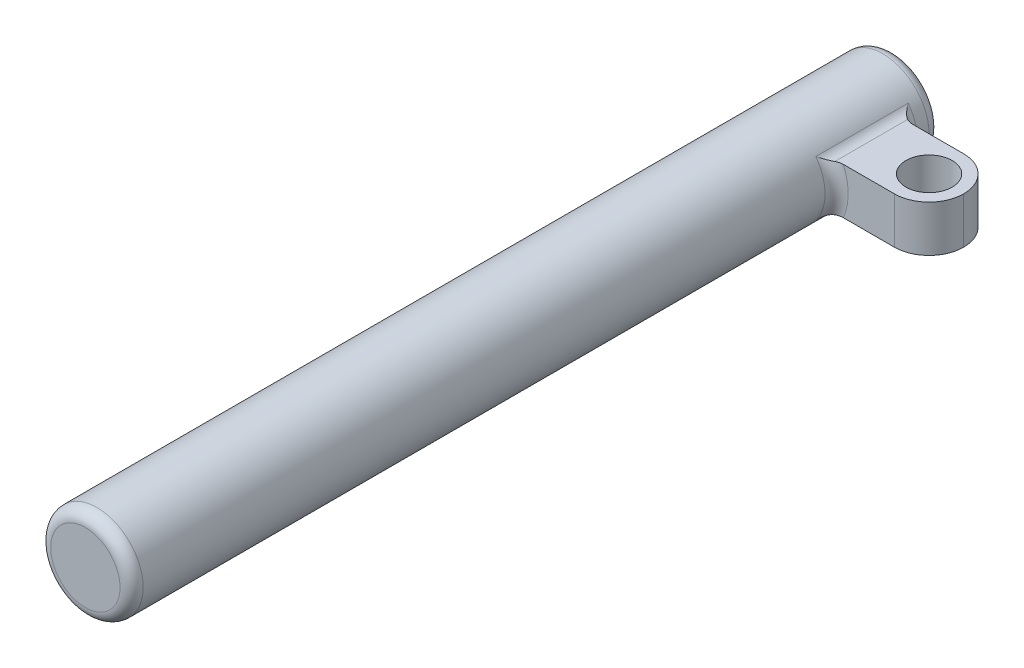
ISO-10303-21;
HEADER;
FILE_DESCRIPTION(('STEP AP214'),'2;1');
FILE_NAME('part.step','',(''),(''),'','','');
FILE_SCHEMA(('AUTOMOTIVE_DESIGN { 1 0 10303 214 1 1 1 1 }'));
ENDSEC;
DATA;
#1=APPLICATION_CONTEXT('core data for automotive mechanical design processes');
#2=APPLICATION_PROTOCOL_DEFINITION('international standard','automotive_design',2000,#1);
#3=PRODUCT_CONTEXT('',#1,'mechanical');
#4=PRODUCT('Part','Part','',(#3));
#5=PRODUCT_RELATED_PRODUCT_CATEGORY('part','',(#4));
#6=PRODUCT_DEFINITION_FORMATION('','',#4);
#7=PRODUCT_DEFINITION_CONTEXT('part definition',#1,'design');
#8=PRODUCT_DEFINITION('design','',#6,#7);
#9=PRODUCT_DEFINITION_SHAPE('','',#8);
#10=(LENGTH_UNIT() NAMED_UNIT(*) SI_UNIT(.MILLI.,.METRE.));
#11=(NAMED_UNIT(*) PLANE_ANGLE_UNIT() SI_UNIT($,.RADIAN.));
#12=(NAMED_UNIT(*) SI_UNIT($,.STERADIAN.) SOLID_ANGLE_UNIT());
#13=UNCERTAINTY_MEASURE_WITH_UNIT(LENGTH_MEASURE(1.E-05),#10,'distance_accuracy_value','');
#14=(GEOMETRIC_REPRESENTATION_CONTEXT(3) GLOBAL_UNCERTAINTY_ASSIGNED_CONTEXT((#13)) GLOBAL_UNIT_ASSIGNED_CONTEXT((#10,
#11,#12)) REPRESENTATION_CONTEXT('',''));
#15=CARTESIAN_POINT('',(0.,0.,0.));
#16=DIRECTION('',(0.,0.,1.));
#17=DIRECTION('',(1.,0.,0.));
#18=AXIS2_PLACEMENT_3D('',#15,#16,#17);
#19=CARTESIAN_POINT('',(0.,0.,88.8999999999999));
#20=DIRECTION('',(0.,0.,-1.));
#21=DIRECTION('',(-1.,0.,0.));
#22=AXIS2_PLACEMENT_3D('',#19,#20,#21);
#23=CYLINDRICAL_SURFACE('',#22,10.16);
#24=CARTESIAN_POINT('',(0.,0.,-83.82));
#25=DIRECTION('',(0.,0.,1.));
#26=DIRECTION('',(1.,0.,0.));
#27=AXIS2_PLACEMENT_3D('',#24,#25,#26);
#28=CIRCLE('',#27,10.16);
#29=CARTESIAN_POINT('',(8.128,6.096,-83.82));
#30=VERTEX_POINT('',#29);
#31=CARTESIAN_POINT('',(8.128,-6.096,-83.82));
#32=VERTEX_POINT('',#31);
#33=EDGE_CURVE('E154',#30,#32,#28,.F.);
#34=ORIENTED_EDGE('',*,*,#33,.T.);
#35=DIRECTION('',(0.,0.,-1.));
#36=VECTOR('',#35,1.);
#37=CARTESIAN_POINT('',(8.128,-6.096,88.8999999999999));
#38=LINE('',#37,#36);
#39=CARTESIAN_POINT('',(8.128,-6.096,-63.5));
#40=VERTEX_POINT('',#39);
#41=EDGE_CURVE('E159',#32,#40,#38,.F.);
#42=ORIENTED_EDGE('',*,*,#41,.T.);
#43=CARTESIAN_POINT('',(0.,0.,-63.5));
#44=DIRECTION('',(0.,0.,-1.));
#45=DIRECTION('',(-1.,0.,0.));
#46=AXIS2_PLACEMENT_3D('',#43,#44,#45);
#47=CIRCLE('',#46,10.16);
#48=CARTESIAN_POINT('',(8.128,6.096,-63.5));
#49=VERTEX_POINT('',#48);
#50=EDGE_CURVE('E156',#40,#49,#47,.F.);
#51=ORIENTED_EDGE('',*,*,#50,.T.);
#52=DIRECTION('',(0.,0.,-1.));
#53=VECTOR('',#52,1.);
#54=CARTESIAN_POINT('',(8.128,6.096,88.8999999999999));
#55=LINE('',#54,#53);
#56=EDGE_CURVE('E152',#49,#30,#55,.T.);
#57=ORIENTED_EDGE('',*,*,#56,.T.);
#58=EDGE_LOOP('',(#34,#42,#51,#57));
#59=FACE_BOUND('',#58,.T.);
#60=CARTESIAN_POINT('',(0.,0.,86.3599999999999));
#61=DIRECTION('',(0.,0.,1.));
#62=DIRECTION('',(1.,0.,0.));
#63=AXIS2_PLACEMENT_3D('',#60,#61,#62);
#64=CIRCLE('',#63,10.16);
#65=CARTESIAN_POINT('',(10.16,0.,86.3599999999999));
#66=VERTEX_POINT('',#65);
#67=EDGE_CURVE('E132',#66,#66,#64,.F.);
#68=ORIENTED_EDGE('',*,*,#67,.T.);
#69=EDGE_LOOP('',(#68));
#70=FACE_BOUND('',#69,.T.);
#71=CARTESIAN_POINT('',(0.,0.,-86.3599999999999));
#72=DIRECTION('',(0.,0.,1.));
#73=DIRECTION('',(1.,0.,0.));
#74=AXIS2_PLACEMENT_3D('',#71,#72,#73);
#75=CIRCLE('',#74,10.16);
#76=CARTESIAN_POINT('',(10.16,0.,-86.3599999999999));
#77=VERTEX_POINT('',#76);
#78=EDGE_CURVE('E230',#77,#77,#75,.T.);
#79=ORIENTED_EDGE('',*,*,#78,.T.);
#80=EDGE_LOOP('',(#79));
#81=FACE_BOUND('',#80,.T.);
#82=ADVANCED_FACE('F34',(#59,#70,#81),#23,.T.);
#83=CARTESIAN_POINT('',(0.,0.,88.8999999999999));
#84=DIRECTION('',(0.,0.,1.));
#85=DIRECTION('',(1.,0.,0.));
#86=AXIS2_PLACEMENT_3D('',#83,#84,#85);
#87=PLANE('',#86);
#88=CARTESIAN_POINT('',(0.,0.,88.8999999999999));
#89=DIRECTION('',(0.,0.,1.));
#90=DIRECTION('',(1.,0.,0.));
#91=AXIS2_PLACEMENT_3D('',#88,#89,#90);
#92=CIRCLE('',#91,7.62);
#93=CARTESIAN_POINT('',(7.62,0.,88.8999999999999));
#94=VERTEX_POINT('',#93);
#95=EDGE_CURVE('E236',#94,#94,#92,.T.);
#96=ORIENTED_EDGE('',*,*,#95,.T.);
#97=EDGE_LOOP('',(#96));
#98=FACE_BOUND('',#97,.T.);
#99=ADVANCED_FACE('F240',(#98),#87,.T.);
#100=CARTESIAN_POINT('',(0.,0.,-88.8999999999999));
#101=DIRECTION('',(0.,0.,1.));
#102=DIRECTION('',(1.,0.,0.));
#103=AXIS2_PLACEMENT_3D('',#100,#101,#102);
#104=PLANE('',#103);
#105=CARTESIAN_POINT('',(0.,0.,-88.8999999999999));
#106=DIRECTION('',(0.,0.,1.));
#107=DIRECTION('',(1.,0.,0.));
#108=AXIS2_PLACEMENT_3D('',#105,#106,#107);
#109=CIRCLE('',#108,7.62);
#110=CARTESIAN_POINT('',(7.62,0.,-88.8999999999999));
#111=VERTEX_POINT('',#110);
#112=EDGE_CURVE('E233',#111,#111,#109,.F.);
#113=ORIENTED_EDGE('',*,*,#112,.T.);
#114=EDGE_LOOP('',(#113));
#115=FACE_BOUND('',#114,.T.);
#116=ADVANCED_FACE('F252',(#115),#104,.F.);
#117=CARTESIAN_POINT('',(0.,0.,-86.3599999999999));
#118=DIRECTION('',(0.,0.,1.));
#119=DIRECTION('',(1.,0.,0.));
#120=AXIS2_PLACEMENT_3D('',#117,#118,#119);
#121=TOROIDAL_SURFACE('',#120,7.62,2.54);
#122=ORIENTED_EDGE('',*,*,#112,.F.);
#123=EDGE_LOOP('',(#122));
#124=FACE_BOUND('',#123,.T.);
#125=ORIENTED_EDGE('',*,*,#78,.F.);
#126=EDGE_LOOP('',(#125));
#127=FACE_BOUND('',#126,.T.);
#128=ADVANCED_FACE('F244',(#124,#127),#121,.T.);
#129=CARTESIAN_POINT('',(0.,0.,86.3599999999999));
#130=DIRECTION('',(0.,0.,1.));
#131=DIRECTION('',(1.,0.,0.));
#132=AXIS2_PLACEMENT_3D('',#129,#130,#131);
#133=TOROIDAL_SURFACE('',#132,7.62,2.54);
#134=ORIENTED_EDGE('',*,*,#67,.F.);
#135=EDGE_LOOP('',(#134));
#136=FACE_BOUND('',#135,.T.);
#137=ORIENTED_EDGE('',*,*,#95,.F.);
#138=EDGE_LOOP('',(#137));
#139=FACE_BOUND('',#138,.T.);
#140=ADVANCED_FACE('F242',(#136,#139),#133,.T.);
#141=CARTESIAN_POINT('',(30.48,5.08,-81.28));
#142=DIRECTION('',(0.,0.,1.));
#143=DIRECTION('',(1.,0.,0.));
#144=AXIS2_PLACEMENT_3D('',#141,#142,#143);
#145=PLANE('',#144);
#146=DIRECTION('',(-1.,0.,0.));
#147=VECTOR('',#146,1.);
#148=CARTESIAN_POINT('',(30.48,-5.08,-81.28));
#149=LINE('',#148,#147);
#150=CARTESIAN_POINT('',(22.86,-5.08,-81.28));
#151=VERTEX_POINT('',#150);
#152=CARTESIAN_POINT('',(11.639742265187,-5.08,-81.28));
#153=VERTEX_POINT('',#152);
#154=EDGE_CURVE('E148',#151,#153,#149,.T.);
#155=ORIENTED_EDGE('',*,*,#154,.T.);
#156=CARTESIAN_POINT('',(0.,0.,-81.28));
#157=DIRECTION('',(0.,0.,1.));
#158=DIRECTION('',(1.,0.,0.));
#159=AXIS2_PLACEMENT_3D('',#156,#157,#158);
#160=CIRCLE('',#159,12.7);
#161=CARTESIAN_POINT('',(11.6397422651878,5.08,-81.28));
#162=VERTEX_POINT('',#161);
#163=EDGE_CURVE('E131',#153,#162,#160,.T.);
#164=ORIENTED_EDGE('',*,*,#163,.T.);
#165=DIRECTION('',(-1.,0.,0.));
#166=VECTOR('',#165,1.);
#167=CARTESIAN_POINT('',(30.48,5.08,-81.28));
#168=LINE('',#167,#166);
#169=CARTESIAN_POINT('',(22.86,5.08,-81.28));
#170=VERTEX_POINT('',#169);
#171=EDGE_CURVE('E114',#170,#162,#168,.T.);
#172=ORIENTED_EDGE('',*,*,#171,.F.);
#173=DIRECTION('',(0.,1.,0.));
#174=VECTOR('',#173,1.);
#175=CARTESIAN_POINT('',(22.86,-5.08,-81.28));
#176=LINE('',#175,#174);
#177=EDGE_CURVE('E123',#170,#151,#176,.F.);
#178=ORIENTED_EDGE('',*,*,#177,.T.);
#179=EDGE_LOOP('',(#155,#164,#172,#178));
#180=FACE_BOUND('',#179,.T.);
#181=ADVANCED_FACE('F128',(#180),#145,.F.);
#182=CARTESIAN_POINT('',(30.48,5.08,-66.04));
#183=DIRECTION('',(0.,-1.,0.));
#184=DIRECTION('',(0.,0.,-1.));
#185=AXIS2_PLACEMENT_3D('',#182,#183,#184);
#186=PLANE('',#185);
#187=CARTESIAN_POINT('',(22.86,5.08,-73.66));
#188=DIRECTION('',(0.,1.,0.));
#189=DIRECTION('',(0.,0.,1.));
#190=AXIS2_PLACEMENT_3D('',#187,#188,#189);
#191=CIRCLE('',#190,5.08);
#192=CARTESIAN_POINT('',(22.86,5.08,-68.58));
#193=VERTEX_POINT('',#192);
#194=EDGE_CURVE('E212',#193,#193,#191,.T.);
#195=ORIENTED_EDGE('',*,*,#194,.F.);
#196=EDGE_LOOP('',(#195));
#197=FACE_BOUND('',#196,.T.);
#198=CARTESIAN_POINT('',(11.6397422651878,5.08,-81.28));
#199=CARTESIAN_POINT('',(11.5529721894488,5.08,-81.2800075483944));
#200=CARTESIAN_POINT('',(11.4662619370639,5.08,-81.2837374348052));
#201=CARTESIAN_POINT('',(11.2934457056713,5.08,-81.2985670088406));
#202=CARTESIAN_POINT('',(11.2073399274719,5.08,-81.3096690383544));
#203=CARTESIAN_POINT('',(10.9544833609675,5.08,-81.3532717952978));
#204=CARTESIAN_POINT('',(10.7893505225094,5.08,-81.3960831725463));
#205=CARTESIAN_POINT('',(10.5485252545902,5.08,-81.4804303992379));
#206=CARTESIAN_POINT('',(10.4691817463516,5.08,-81.5120190329636));
#207=CARTESIAN_POINT('',(10.3126182193424,5.08,-81.5821612619866));
#208=CARTESIAN_POINT('',(10.2354299010521,5.08,-81.6207855930415));
#209=CARTESIAN_POINT('',(10.1600000000002,5.08,-81.6627046394262));
#210=B_SPLINE_CURVE_WITH_KNOTS('',3,(#198,#199,#200,#201,#202,#203,#204,#205,#206,#207,#208,
#209),.UNSPECIFIED.,.F.,.F.,(4,2,2,2,2,4),(0.,0.260113846666097,0.520310362564777,
1.02931486202198,1.28526574378753,1.54394827035968),.UNSPECIFIED.);
#211=CARTESIAN_POINT('',(10.16,5.08,-81.6627046394256));
#212=VERTEX_POINT('',#211);
#213=EDGE_CURVE('E47',#162,#212,#210,.T.);
#214=ORIENTED_EDGE('',*,*,#213,.T.);
#215=DIRECTION('',(0.,0.,1.));
#216=VECTOR('',#215,1.);
#217=CARTESIAN_POINT('',(10.16,5.08,-66.04));
#218=LINE('',#217,#216);
#219=CARTESIAN_POINT('',(10.16,5.08,-65.6572953605744));
#220=VERTEX_POINT('',#219);
#221=EDGE_CURVE('E62',#212,#220,#218,.T.);
#222=ORIENTED_EDGE('',*,*,#221,.T.);
#223=CARTESIAN_POINT('',(10.16,5.08,-65.6572953605744));
#224=CARTESIAN_POINT('',(10.2356769477195,5.08,-65.699351872378));
#225=CARTESIAN_POINT('',(10.3131252682367,5.08,-65.7380924161117));
#226=CARTESIAN_POINT('',(10.4710759135969,5.08,-65.8088027103348));
#227=CARTESIAN_POINT('',(10.5515789351582,5.08,-65.8407709051035));
#228=CARTESIAN_POINT('',(10.7933260807005,5.08,-65.9250419121657));
#229=CARTESIAN_POINT('',(10.9581475765227,5.08,-65.9675473870331));
#230=CARTESIAN_POINT('',(11.2096628164952,5.08,-66.0106335566876));
#231=CARTESIAN_POINT('',(11.2947462456063,5.08,-66.0215522392064));
#232=CARTESIAN_POINT('',(11.4664426099808,5.08,-66.0362703357228));
#233=CARTESIAN_POINT('',(11.5530621726755,5.08,-66.0399923973269));
#234=CARTESIAN_POINT('',(11.639742265187,5.08,-66.04));
#235=B_SPLINE_CURVE_WITH_KNOTS('',3,(#223,#224,#225,#226,#227,#228,#229,#230,#231,#232,#233,
#234),.UNSPECIFIED.,.F.,.F.,(4,2,2,2,2,4),(0.,0.259532022388559,0.519123599084913,
1.027014171978,1.28410848560441,1.54395112586037),.UNSPECIFIED.);
#236=CARTESIAN_POINT('',(11.639742265187,5.08,-66.04));
#237=VERTEX_POINT('',#236);
#238=EDGE_CURVE('E171',#220,#237,#235,.T.);
#239=ORIENTED_EDGE('',*,*,#238,.T.);
#240=DIRECTION('',(-1.,0.,0.));
#241=VECTOR('',#240,1.);
#242=CARTESIAN_POINT('',(30.48,5.08,-66.04));
#243=LINE('',#242,#241);
#244=CARTESIAN_POINT('',(22.86,5.08,-66.04));
#245=VERTEX_POINT('',#244);
#246=EDGE_CURVE('E133',#245,#237,#243,.T.);
#247=ORIENTED_EDGE('',*,*,#246,.F.);
#248=CARTESIAN_POINT('',(22.86,5.08,-73.66));
#249=DIRECTION('',(0.,-1.,0.));
#250=DIRECTION('',(0.,0.,-1.));
#251=AXIS2_PLACEMENT_3D('',#248,#249,#250);
#252=CIRCLE('',#251,7.62);
#253=CARTESIAN_POINT('',(30.48,5.08,-73.66));
#254=VERTEX_POINT('',#253);
#255=EDGE_CURVE('E118',#245,#254,#252,.F.);
#256=ORIENTED_EDGE('',*,*,#255,.T.);
#257=CARTESIAN_POINT('',(22.86,5.08,-73.66));
#258=DIRECTION('',(0.,-1.,0.));
#259=DIRECTION('',(0.,0.,-1.));
#260=AXIS2_PLACEMENT_3D('',#257,#258,#259);
#261=CIRCLE('',#260,7.62);
#262=EDGE_CURVE('E111',#254,#170,#261,.F.);
#263=ORIENTED_EDGE('',*,*,#262,.T.);
#264=ORIENTED_EDGE('',*,*,#171,.T.);
#265=EDGE_LOOP('',(#214,#222,#239,#247,#256,#263,#264));
#266=FACE_BOUND('',#265,.T.);
#267=ADVANCED_FACE('F113',(#197,#266),#186,.F.);
#268=CARTESIAN_POINT('',(30.48,5.08,-66.04));
#269=DIRECTION('',(0.,0.,-1.));
#270=DIRECTION('',(-1.,0.,0.));
#271=AXIS2_PLACEMENT_3D('',#268,#269,#270);
#272=PLANE('',#271);
#273=ORIENTED_EDGE('',*,*,#246,.T.);
#274=CARTESIAN_POINT('',(0.,0.,-66.04));
#275=DIRECTION('',(0.,0.,-1.));
#276=DIRECTION('',(-1.,0.,0.));
#277=AXIS2_PLACEMENT_3D('',#274,#275,#276);
#278=CIRCLE('',#277,12.7);
#279=CARTESIAN_POINT('',(11.6397422651878,-5.08,-66.04));
#280=VERTEX_POINT('',#279);
#281=EDGE_CURVE('E145',#237,#280,#278,.T.);
#282=ORIENTED_EDGE('',*,*,#281,.T.);
#283=DIRECTION('',(-1.,0.,0.));
#284=VECTOR('',#283,1.);
#285=CARTESIAN_POINT('',(30.48,-5.08,-66.04));
#286=LINE('',#285,#284);
#287=CARTESIAN_POINT('',(22.86,-5.08,-66.04));
#288=VERTEX_POINT('',#287);
#289=EDGE_CURVE('E223',#288,#280,#286,.T.);
#290=ORIENTED_EDGE('',*,*,#289,.F.);
#291=DIRECTION('',(0.,-1.,0.));
#292=VECTOR('',#291,1.);
#293=CARTESIAN_POINT('',(22.86,5.08,-66.04));
#294=LINE('',#293,#292);
#295=EDGE_CURVE('E143',#288,#245,#294,.F.);
#296=ORIENTED_EDGE('',*,*,#295,.T.);
#297=EDGE_LOOP('',(#273,#282,#290,#296));
#298=FACE_BOUND('',#297,.T.);
#299=ADVANCED_FACE('F270',(#298),#272,.F.);
#300=CARTESIAN_POINT('',(30.48,-5.08,-66.04));
#301=DIRECTION('',(0.,1.,0.));
#302=DIRECTION('',(0.,0.,1.));
#303=AXIS2_PLACEMENT_3D('',#300,#301,#302);
#304=PLANE('',#303);
#305=CARTESIAN_POINT('',(22.86,-5.08,-73.66));
#306=DIRECTION('',(0.,1.,0.));
#307=DIRECTION('',(0.,0.,1.));
#308=AXIS2_PLACEMENT_3D('',#305,#306,#307);
#309=CIRCLE('',#308,5.08);
#310=CARTESIAN_POINT('',(22.86,-5.08,-68.58));
#311=VERTEX_POINT('',#310);
#312=EDGE_CURVE('E149',#311,#311,#309,.F.);
#313=ORIENTED_EDGE('',*,*,#312,.F.);
#314=EDGE_LOOP('',(#313));
#315=FACE_BOUND('',#314,.T.);
#316=CARTESIAN_POINT('',(11.6397422651878,-5.08,-66.04));
#317=CARTESIAN_POINT('',(11.5529721894488,-5.08,-66.0399924516056));
#318=CARTESIAN_POINT('',(11.4662619370639,-5.08,-66.0362625651947));
#319=CARTESIAN_POINT('',(11.2934457056713,-5.08,-66.0214329911593));
#320=CARTESIAN_POINT('',(11.2073399274719,-5.08,-66.0103309616456));
#321=CARTESIAN_POINT('',(10.9544833609675,-5.08,-65.9667282047022));
#322=CARTESIAN_POINT('',(10.7893505225094,-5.08,-65.9239168274537));
#323=CARTESIAN_POINT('',(10.5485252545902,-5.08,-65.839569600762));
#324=CARTESIAN_POINT('',(10.4691817463516,-5.08,-65.8079809670364));
#325=CARTESIAN_POINT('',(10.3126182193424,-5.08,-65.7378387380133));
#326=CARTESIAN_POINT('',(10.2354299010521,-5.08,-65.6992144069584));
#327=CARTESIAN_POINT('',(10.1600000000002,-5.08,-65.6572953605738));
#328=B_SPLINE_CURVE_WITH_KNOTS('',3,(#316,#317,#318,#319,#320,#321,#322,#323,#324,#325,#326,
#327),.UNSPECIFIED.,.F.,.F.,(4,2,2,2,2,4),(0.,0.260113846666097,0.520310362564777,
1.02931486202198,1.28526574378753,1.54394827035968),.UNSPECIFIED.);
#329=CARTESIAN_POINT('',(10.16,-5.08,-65.6572953605744));
#330=VERTEX_POINT('',#329);
#331=EDGE_CURVE('E164',#280,#330,#328,.T.);
#332=ORIENTED_EDGE('',*,*,#331,.T.);
#333=DIRECTION('',(0.,0.,1.));
#334=VECTOR('',#333,1.);
#335=CARTESIAN_POINT('',(10.16,-5.08,-81.28));
#336=LINE('',#335,#334);
#337=CARTESIAN_POINT('',(10.16,-5.08,-81.6627046394256));
#338=VERTEX_POINT('',#337);
#339=EDGE_CURVE('E54',#330,#338,#336,.F.);
#340=ORIENTED_EDGE('',*,*,#339,.T.);
#341=CARTESIAN_POINT('',(10.16,-5.08,-81.6627046394256));
#342=CARTESIAN_POINT('',(10.2356769477195,-5.08,-81.620648127622));
#343=CARTESIAN_POINT('',(10.3131252682367,-5.08,-81.5819075838883));
#344=CARTESIAN_POINT('',(10.4710759135969,-5.08,-81.5111972896652));
#345=CARTESIAN_POINT('',(10.5515789351582,-5.08,-81.4792290948965));
#346=CARTESIAN_POINT('',(10.7933260807005,-5.08,-81.3949580878342));
#347=CARTESIAN_POINT('',(10.9581475765227,-5.08,-81.3524526129669));
#348=CARTESIAN_POINT('',(11.2096628164952,-5.08,-81.3093664433124));
#349=CARTESIAN_POINT('',(11.2947462456063,-5.08,-81.2984477607936));
#350=CARTESIAN_POINT('',(11.4664426099808,-5.08,-81.2837296642771));
#351=CARTESIAN_POINT('',(11.5530621726755,-5.08,-81.2800076026731));
#352=CARTESIAN_POINT('',(11.639742265187,-5.08,-81.28));
#353=B_SPLINE_CURVE_WITH_KNOTS('',3,(#341,#342,#343,#344,#345,#346,#347,#348,#349,#350,#351,
#352),.UNSPECIFIED.,.F.,.F.,(4,2,2,2,2,4),(0.,0.259532022388559,0.519123599084913,
1.027014171978,1.28410848560441,1.54395112586037),.UNSPECIFIED.);
#354=EDGE_CURVE('E11',#338,#153,#353,.T.);
#355=ORIENTED_EDGE('',*,*,#354,.T.);
#356=ORIENTED_EDGE('',*,*,#154,.F.);
#357=CARTESIAN_POINT('',(22.86,-5.08,-73.66));
#358=DIRECTION('',(0.,1.,0.));
#359=DIRECTION('',(0.,0.,1.));
#360=AXIS2_PLACEMENT_3D('',#357,#358,#359);
#361=CIRCLE('',#360,7.62);
#362=CARTESIAN_POINT('',(30.48,-5.08,-73.66));
#363=VERTEX_POINT('',#362);
#364=EDGE_CURVE('E136',#151,#363,#361,.F.);
#365=ORIENTED_EDGE('',*,*,#364,.T.);
#366=CARTESIAN_POINT('',(22.86,-5.08,-73.66));
#367=DIRECTION('',(0.,1.,0.));
#368=DIRECTION('',(0.,0.,1.));
#369=AXIS2_PLACEMENT_3D('',#366,#367,#368);
#370=CIRCLE('',#369,7.62);
#371=EDGE_CURVE('E137',#363,#288,#370,.F.);
#372=ORIENTED_EDGE('',*,*,#371,.T.);
#373=ORIENTED_EDGE('',*,*,#289,.T.);
#374=EDGE_LOOP('',(#332,#340,#355,#356,#365,#372,#373));
#375=FACE_BOUND('',#374,.T.);
#376=ADVANCED_FACE('F177',(#315,#375),#304,.F.);
#377=CARTESIAN_POINT('',(22.86,0.,-73.66));
#378=DIRECTION('',(0.,1.,0.));
#379=DIRECTION('',(0.,0.,1.));
#380=AXIS2_PLACEMENT_3D('',#377,#378,#379);
#381=CYLINDRICAL_SURFACE('',#380,7.62);
#382=ORIENTED_EDGE('',*,*,#295,.F.);
#383=ORIENTED_EDGE('',*,*,#371,.F.);
#384=DIRECTION('',(0.,-1.,0.));
#385=VECTOR('',#384,1.);
#386=CARTESIAN_POINT('',(30.48,-5.08,-73.66));
#387=LINE('',#386,#385);
#388=EDGE_CURVE('E146',#254,#363,#387,.T.);
#389=ORIENTED_EDGE('',*,*,#388,.F.);
#390=ORIENTED_EDGE('',*,*,#255,.F.);
#391=EDGE_LOOP('',(#382,#383,#389,#390));
#392=FACE_BOUND('',#391,.T.);
#393=ADVANCED_FACE('F289',(#392),#381,.T.);
#394=CARTESIAN_POINT('',(22.86,0.,-73.66));
#395=DIRECTION('',(0.,-1.,0.));
#396=DIRECTION('',(0.,0.,-1.));
#397=AXIS2_PLACEMENT_3D('',#394,#395,#396);
#398=CYLINDRICAL_SURFACE('',#397,7.62);
#399=ORIENTED_EDGE('',*,*,#364,.F.);
#400=ORIENTED_EDGE('',*,*,#177,.F.);
#401=ORIENTED_EDGE('',*,*,#262,.F.);
#402=ORIENTED_EDGE('',*,*,#388,.T.);
#403=EDGE_LOOP('',(#399,#400,#401,#402));
#404=FACE_BOUND('',#403,.T.);
#405=ADVANCED_FACE('F135',(#404),#398,.T.);
#406=CARTESIAN_POINT('',(22.86,-10.161,-73.66));
#407=DIRECTION('',(0.,1.,0.));
#408=DIRECTION('',(0.,0.,1.));
#409=AXIS2_PLACEMENT_3D('',#406,#407,#408);
#410=CYLINDRICAL_SURFACE('',#409,5.08);
#411=CARTESIAN_POINT('',(22.86,5.08,-68.58));
#412=CARTESIAN_POINT('',(22.86,4.97416666666667,-68.58));
#413=CARTESIAN_POINT('',(22.86,4.86833333333333,-68.58));
#414=CARTESIAN_POINT('',(22.86,4.65666666666667,-68.58));
#415=CARTESIAN_POINT('',(22.86,4.55083333333333,-68.58));
#416=CARTESIAN_POINT('',(22.86,4.33916666666667,-68.58));
#417=CARTESIAN_POINT('',(22.86,4.23333333333333,-68.58));
#418=CARTESIAN_POINT('',(22.86,4.02166666666667,-68.58));
#419=CARTESIAN_POINT('',(22.86,3.91583333333333,-68.58));
#420=CARTESIAN_POINT('',(22.86,3.70416666666667,-68.58));
#421=CARTESIAN_POINT('',(22.86,3.59833333333333,-68.58));
#422=CARTESIAN_POINT('',(22.86,3.38666666666667,-68.58));
#423=CARTESIAN_POINT('',(22.86,3.28083333333333,-68.58));
#424=CARTESIAN_POINT('',(22.86,3.06916666666667,-68.58));
#425=CARTESIAN_POINT('',(22.86,2.96333333333333,-68.58));
#426=CARTESIAN_POINT('',(22.86,2.75166666666667,-68.58));
#427=CARTESIAN_POINT('',(22.86,2.64583333333333,-68.58));
#428=CARTESIAN_POINT('',(22.86,2.43416666666667,-68.58));
#429=CARTESIAN_POINT('',(22.86,2.32833333333333,-68.58));
#430=CARTESIAN_POINT('',(22.86,2.11666666666667,-68.58));
#431=CARTESIAN_POINT('',(22.86,2.01083333333333,-68.58));
#432=CARTESIAN_POINT('',(22.86,1.79916666666667,-68.58));
#433=CARTESIAN_POINT('',(22.86,1.69333333333333,-68.58));
#434=CARTESIAN_POINT('',(22.86,1.48166666666667,-68.58));
#435=CARTESIAN_POINT('',(22.86,1.37583333333333,-68.58));
#436=CARTESIAN_POINT('',(22.86,1.16416666666667,-68.58));
#437=CARTESIAN_POINT('',(22.86,1.05833333333333,-68.58));
#438=CARTESIAN_POINT('',(22.86,0.846666666666665,-68.58));
#439=CARTESIAN_POINT('',(22.86,0.740833333333332,-68.58));
#440=CARTESIAN_POINT('',(22.86,0.529166666666665,-68.58));
#441=CARTESIAN_POINT('',(22.86,0.423333333333332,-68.58));
#442=CARTESIAN_POINT('',(22.86,0.211666666666665,-68.58));
#443=CARTESIAN_POINT('',(22.86,0.105833333333332,-68.58));
#444=CARTESIAN_POINT('',(22.86,-0.105833333333335,-68.58));
#445=CARTESIAN_POINT('',(22.86,-0.211666666666668,-68.58));
#446=CARTESIAN_POINT('',(22.86,-0.423333333333335,-68.58));
#447=CARTESIAN_POINT('',(22.86,-0.529166666666669,-68.58));
#448=CARTESIAN_POINT('',(22.86,-0.740833333333335,-68.58));
#449=CARTESIAN_POINT('',(22.86,-0.846666666666669,-68.58));
#450=CARTESIAN_POINT('',(22.86,-1.05833333333334,-68.58));
#451=CARTESIAN_POINT('',(22.86,-1.16416666666667,-68.58));
#452=CARTESIAN_POINT('',(22.86,-1.37583333333334,-68.58));
#453=CARTESIAN_POINT('',(22.86,-1.48166666666667,-68.58));
#454=CARTESIAN_POINT('',(22.86,-1.69333333333334,-68.58));
#455=CARTESIAN_POINT('',(22.86,-1.79916666666667,-68.58));
#456=CARTESIAN_POINT('',(22.86,-2.01083333333334,-68.58));
#457=CARTESIAN_POINT('',(22.86,-2.11666666666667,-68.58));
#458=CARTESIAN_POINT('',(22.86,-2.32833333333334,-68.58));
#459=CARTESIAN_POINT('',(22.86,-2.43416666666667,-68.58));
#460=CARTESIAN_POINT('',(22.86,-2.64583333333333,-68.58));
#461=CARTESIAN_POINT('',(22.86,-2.75166666666667,-68.58));
#462=CARTESIAN_POINT('',(22.86,-2.96333333333333,-68.58));
#463=CARTESIAN_POINT('',(22.86,-3.06916666666667,-68.58));
#464=CARTESIAN_POINT('',(22.86,-3.28083333333333,-68.58));
#465=CARTESIAN_POINT('',(22.86,-3.38666666666667,-68.58));
#466=CARTESIAN_POINT('',(22.86,-3.59833333333333,-68.58));
#467=CARTESIAN_POINT('',(22.86,-3.70416666666667,-68.58));
#468=CARTESIAN_POINT('',(22.86,-3.91583333333334,-68.58));
#469=CARTESIAN_POINT('',(22.86,-4.02166666666667,-68.58));
#470=CARTESIAN_POINT('',(22.86,-4.23333333333334,-68.58));
#471=CARTESIAN_POINT('',(22.86,-4.33916666666667,-68.58));
#472=CARTESIAN_POINT('',(22.86,-4.55083333333334,-68.58));
#473=CARTESIAN_POINT('',(22.86,-4.65666666666667,-68.58));
#474=CARTESIAN_POINT('',(22.86,-4.86833333333334,-68.58));
#475=CARTESIAN_POINT('',(22.86,-4.97416666666667,-68.58));
#476=CARTESIAN_POINT('',(22.86,-5.08,-68.58));
#477=B_SPLINE_CURVE_WITH_KNOTS('',3,(#411,#412,#413,#414,#415,#416,#417,#418,#419,#420,#421,
#422,#423,#424,#425,#426,#427,#428,#429,#430,#431,#432,#433,#434,#435,#436,#437,#438,#439,#440,
#441,#442,#443,#444,#445,#446,#447,#448,#449,#450,#451,#452,#453,#454,#455,#456,#457,#458,#459,
#460,#461,#462,#463,#464,#465,#466,#467,#468,#469,#470,#471,#472,#473,#474,#475,#476),
.UNSPECIFIED.,.F.,.F.,(4,2,2,2,2,2,2,2,2,2,2,2,2,2,2,2,2,2,2,2,2,2,2,2,2,2,2,2,2,2,2,2,4),(0.,
0.3175,0.635,0.9525,1.27,1.5875,1.905,2.2225,2.54,2.8575,3.175,3.4925,3.81,4.1275,4.445,4.7625,
5.08,5.3975,5.715,6.0325,6.35,6.6675,6.985,7.3025,7.62,7.9375,8.255,8.5725,8.89,9.2075,9.525,
9.8425,10.16),.UNSPECIFIED.);
#478=EDGE_CURVE('BSEAM295',#193,#311,#477,.T.);
#479=ORIENTED_EDGE('',*,*,#194,.T.);
#480=ORIENTED_EDGE('',*,*,#312,.T.);
#481=ORIENTED_EDGE('',*,*,#478,.T.);
#482=ORIENTED_EDGE('',*,*,#478,.F.);
#483=EDGE_LOOP('',(#479,#481,#480,#482));
#484=FACE_BOUND('',#483,.T.);
#485=ADVANCED_FACE('F295',(#484),#410,.F.);
#486=CARTESIAN_POINT('',(0.,0.,-83.82));
#487=DIRECTION('',(0.,0.,1.));
#488=DIRECTION('',(1.,0.,0.));
#489=AXIS2_PLACEMENT_3D('',#486,#487,#488);
#490=TOROIDAL_SURFACE('',#489,12.7,2.54);
#491=CARTESIAN_POINT('',(10.16,-5.08,-81.6627046394256));
#492=CARTESIAN_POINT('',(10.0803807114727,-5.08001303324733,-81.7069659638936));
#493=CARTESIAN_POINT('',(10.0024453940569,-5.08374192683027,-81.7540301126423));
#494=CARTESIAN_POINT('',(9.8503933074028,-5.09778396658909,-81.8527373788629));
#495=CARTESIAN_POINT('',(9.77626795586274,-5.10808154436598,-81.9043694214443));
#496=CARTESIAN_POINT('',(9.63249805013261,-5.13431373059196,-82.0109658425098));
#497=CARTESIAN_POINT('',(9.56282181382748,-5.15020155845952,-82.0658995215949));
#498=CARTESIAN_POINT('',(9.42729474198165,-5.18696150487865,-82.1788132382075));
#499=CARTESIAN_POINT('',(9.36144685645978,-5.20783740542976,-82.2367955610988));
#500=CARTESIAN_POINT('',(9.20791646880873,-5.26326131485612,-82.3789657930158));
#501=CARTESIAN_POINT('',(9.12208446763383,-5.29993320672846,-82.4643268739561));
#502=CARTESIAN_POINT('',(8.95775432226324,-5.38067234293529,-82.6385172702797));
#503=CARTESIAN_POINT('',(8.87925831845686,-5.42474173518192,-82.7273475872131));
#504=CARTESIAN_POINT('',(8.72910612833124,-5.51951238107924,-82.9077491233814));
#505=CARTESIAN_POINT('',(8.6574723574709,-5.57023416677301,-82.9993281221329));
#506=CARTESIAN_POINT('',(8.52111833985149,-5.67752991905857,-83.1841088887021));
#507=CARTESIAN_POINT('',(8.45639547104084,-5.73410164998308,-83.2773100253465));
#508=CARTESIAN_POINT('',(8.34707298273806,-5.83973506077841,-83.4442351588987));
#509=CARTESIAN_POINT('',(8.30116286695097,-5.88774439483786,-83.5177746208741));
#510=CARTESIAN_POINT('',(8.21349942377359,-5.98687227927811,-83.6650418748152));
#511=CARTESIAN_POINT('',(8.17173968629291,-6.03798583220995,-83.7387691901388));
#512=CARTESIAN_POINT('',(8.13069028024783,-6.09241790233906,-83.8149913795937));
#513=CARTESIAN_POINT('',(8.12934395155206,-6.09420806937309,-83.8174956984086));
#514=CARTESIAN_POINT('',(8.128,-6.096,-83.82));
#515=B_SPLINE_CURVE_WITH_KNOTS('',3,(#491,#492,#493,#494,#495,#496,#497,#498,#499,#500,#501,
#502,#503,#504,#505,#506,#507,#508,#509,#510,#511,#512,#513,#514),.UNSPECIFIED.,.F.,.F.,(4,2,2,
2,2,2,2,2,2,2,2,4),(0.,0.272992598182949,0.545340570177885,0.815461644221112,1.08578817994297,
1.46467060458648,1.8436632310921,2.22385439417566,2.60390079326203,2.90107444101297,
3.19778174117082,3.2078614276249),.UNSPECIFIED.);
#516=EDGE_CURVE('E204',#32,#338,#515,.F.);
#517=ORIENTED_EDGE('',*,*,#516,.F.);
#518=ORIENTED_EDGE('',*,*,#33,.F.);
#519=CARTESIAN_POINT('',(10.16,5.08,-81.6627046394256));
#520=CARTESIAN_POINT('',(10.0803807114727,5.08001303324733,-81.7069659638936));
#521=CARTESIAN_POINT('',(10.0024453940569,5.08374192683027,-81.7540301126423));
#522=CARTESIAN_POINT('',(9.8503933074028,5.09778396658909,-81.8527373788629));
#523=CARTESIAN_POINT('',(9.77626795586274,5.10808154436598,-81.9043694214443));
#524=CARTESIAN_POINT('',(9.63249805013261,5.13431373059196,-82.0109658425098));
#525=CARTESIAN_POINT('',(9.56282181382748,5.15020155845952,-82.0658995215949));
#526=CARTESIAN_POINT('',(9.42729474198165,5.18696150487865,-82.1788132382075));
#527=CARTESIAN_POINT('',(9.36144685645978,5.20783740542976,-82.2367955610988));
#528=CARTESIAN_POINT('',(9.20791646880873,5.26326131485612,-82.3789657930158));
#529=CARTESIAN_POINT('',(9.12208446763383,5.29993320672846,-82.4643268739561));
#530=CARTESIAN_POINT('',(8.95775432226324,5.38067234293529,-82.6385172702797));
#531=CARTESIAN_POINT('',(8.87925831845686,5.42474173518192,-82.7273475872131));
#532=CARTESIAN_POINT('',(8.72910612833124,5.51951238107924,-82.9077491233814));
#533=CARTESIAN_POINT('',(8.6574723574709,5.57023416677301,-82.9993281221329));
#534=CARTESIAN_POINT('',(8.52111833985149,5.67752991905857,-83.1841088887021));
#535=CARTESIAN_POINT('',(8.45639547104084,5.73410164998308,-83.2773100253465));
#536=CARTESIAN_POINT('',(8.34707298273806,5.83973506077841,-83.4442351588987));
#537=CARTESIAN_POINT('',(8.30116286695097,5.88774439483786,-83.5177746208741));
#538=CARTESIAN_POINT('',(8.21349942377359,5.98687227927811,-83.6650418748152));
#539=CARTESIAN_POINT('',(8.17173968629291,6.03798583220995,-83.7387691901388));
#540=CARTESIAN_POINT('',(8.13069028024783,6.09241790233906,-83.8149913795937));
#541=CARTESIAN_POINT('',(8.12934395155206,6.09420806937309,-83.8174956984086));
#542=CARTESIAN_POINT('',(8.128,6.096,-83.82));
#543=B_SPLINE_CURVE_WITH_KNOTS('',3,(#519,#520,#521,#522,#523,#524,#525,#526,#527,#528,#529,
#530,#531,#532,#533,#534,#535,#536,#537,#538,#539,#540,#541,#542),.UNSPECIFIED.,.F.,.F.,(4,2,2,
2,2,2,2,2,2,2,2,4),(0.,0.272992598182949,0.545340570177885,0.815461644221112,1.08578817994297,
1.46467060458648,1.8436632310921,2.22385439417566,2.60390079326203,2.90107444101297,
3.19778174117082,3.2078614276249),.UNSPECIFIED.);
#544=EDGE_CURVE('E39',#212,#30,#543,.T.);
#545=ORIENTED_EDGE('',*,*,#544,.F.);
#546=ORIENTED_EDGE('',*,*,#213,.F.);
#547=ORIENTED_EDGE('',*,*,#163,.F.);
#548=ORIENTED_EDGE('',*,*,#354,.F.);
#549=EDGE_LOOP('',(#517,#518,#545,#546,#547,#548));
#550=FACE_BOUND('',#549,.T.);
#551=ADVANCED_FACE('F36',(#550),#490,.F.);
#552=CARTESIAN_POINT('',(10.16,7.62,88.8999999999999));
#553=DIRECTION('',(0.,0.,-1.));
#554=DIRECTION('',(-1.,0.,0.));
#555=AXIS2_PLACEMENT_3D('',#552,#553,#554);
#556=CYLINDRICAL_SURFACE('',#555,2.54);
#557=ORIENTED_EDGE('',*,*,#544,.T.);
#558=ORIENTED_EDGE('',*,*,#56,.F.);
#559=CARTESIAN_POINT('',(10.16,5.08,-65.6572953605744));
#560=CARTESIAN_POINT('',(10.0803807114727,5.08001303324733,-65.6130340361064));
#561=CARTESIAN_POINT('',(10.0024453940569,5.08374192683027,-65.5659698873577));
#562=CARTESIAN_POINT('',(9.8503933074028,5.09778396658909,-65.4672626211371));
#563=CARTESIAN_POINT('',(9.77626795586274,5.10808154436598,-65.4156305785556));
#564=CARTESIAN_POINT('',(9.63249805013261,5.13431373059196,-65.3090341574901));
#565=CARTESIAN_POINT('',(9.56282181382748,5.15020155845952,-65.2541004784051));
#566=CARTESIAN_POINT('',(9.42729474198165,5.18696150487865,-65.1411867617925));
#567=CARTESIAN_POINT('',(9.36144685645978,5.20783740542976,-65.0832044389012));
#568=CARTESIAN_POINT('',(9.20791646880872,5.26326131485612,-64.9410342069842));
#569=CARTESIAN_POINT('',(9.12208446763383,5.29993320672846,-64.8556731260438));
#570=CARTESIAN_POINT('',(8.95775432226322,5.3806723429353,-64.6814827297203));
#571=CARTESIAN_POINT('',(8.87925831845684,5.42474173518193,-64.5926524127869));
#572=CARTESIAN_POINT('',(8.72910612833123,5.51951238107925,-64.4122508766186));
#573=CARTESIAN_POINT('',(8.6574723574709,5.57023416677301,-64.320671877867));
#574=CARTESIAN_POINT('',(8.52111833985149,5.67752991905857,-64.1358911112979));
#575=CARTESIAN_POINT('',(8.45639547104084,5.73410164998308,-64.0426899746535));
#576=CARTESIAN_POINT('',(8.34707298273806,5.83973506077841,-63.8757648411012));
#577=CARTESIAN_POINT('',(8.30116286695097,5.88774439483787,-63.8022253791259));
#578=CARTESIAN_POINT('',(8.21349942377359,5.98687227927812,-63.6549581251848));
#579=CARTESIAN_POINT('',(8.17173968629291,6.03798583220995,-63.5812308098612));
#580=CARTESIAN_POINT('',(8.13069028024783,6.09241790233906,-63.5050086204063));
#581=CARTESIAN_POINT('',(8.12934395155206,6.09420806937309,-63.5025043015914));
#582=CARTESIAN_POINT('',(8.128,6.096,-63.5));
#583=B_SPLINE_CURVE_WITH_KNOTS('',3,(#559,#560,#561,#562,#563,#564,#565,#566,#567,#568,#569,
#570,#571,#572,#573,#574,#575,#576,#577,#578,#579,#580,#581,#582),.UNSPECIFIED.,.F.,.F.,(4,2,2,
2,2,2,2,2,2,2,2,4),(0.,0.272992598182949,0.545340570177885,0.815461644221112,1.08578817994297,
1.4646706045865,1.84366323109212,2.22385439417566,2.60390079326203,2.90107444101297,
3.19778174117082,3.2078614276249),.UNSPECIFIED.);
#584=EDGE_CURVE('E200',#220,#49,#583,.T.);
#585=ORIENTED_EDGE('',*,*,#584,.F.);
#586=ORIENTED_EDGE('',*,*,#221,.F.);
#587=EDGE_LOOP('',(#557,#558,#585,#586));
#588=FACE_BOUND('',#587,.T.);
#589=ADVANCED_FACE('F189',(#588),#556,.F.);
#590=CARTESIAN_POINT('',(10.16,-7.62,88.8999999999999));
#591=DIRECTION('',(0.,0.,-1.));
#592=DIRECTION('',(-1.,0.,0.));
#593=AXIS2_PLACEMENT_3D('',#590,#591,#592);
#594=CYLINDRICAL_SURFACE('',#593,2.54);
#595=ORIENTED_EDGE('',*,*,#339,.F.);
#596=CARTESIAN_POINT('',(10.16,-5.08,-65.6572953605744));
#597=CARTESIAN_POINT('',(10.0803807114727,-5.08001303324733,-65.6130340361064));
#598=CARTESIAN_POINT('',(10.0024453940569,-5.08374192683027,-65.5659698873577));
#599=CARTESIAN_POINT('',(9.8503933074028,-5.09778396658909,-65.4672626211371));
#600=CARTESIAN_POINT('',(9.77626795586274,-5.10808154436598,-65.4156305785556));
#601=CARTESIAN_POINT('',(9.63249805013261,-5.13431373059196,-65.3090341574901));
#602=CARTESIAN_POINT('',(9.56282181382748,-5.15020155845952,-65.2541004784051));
#603=CARTESIAN_POINT('',(9.42729474198165,-5.18696150487865,-65.1411867617925));
#604=CARTESIAN_POINT('',(9.36144685645978,-5.20783740542976,-65.0832044389012));
#605=CARTESIAN_POINT('',(9.20791646880872,-5.26326131485612,-64.9410342069842));
#606=CARTESIAN_POINT('',(9.12208446763383,-5.29993320672846,-64.8556731260438));
#607=CARTESIAN_POINT('',(8.95775432226322,-5.3806723429353,-64.6814827297203));
#608=CARTESIAN_POINT('',(8.87925831845684,-5.42474173518193,-64.5926524127869));
#609=CARTESIAN_POINT('',(8.72910612833123,-5.51951238107925,-64.4122508766186));
#610=CARTESIAN_POINT('',(8.6574723574709,-5.57023416677301,-64.320671877867));
#611=CARTESIAN_POINT('',(8.52111833985149,-5.67752991905857,-64.1358911112979));
#612=CARTESIAN_POINT('',(8.45639547104084,-5.73410164998308,-64.0426899746535));
#613=CARTESIAN_POINT('',(8.34707298273806,-5.83973506077841,-63.8757648411012));
#614=CARTESIAN_POINT('',(8.30116286695097,-5.88774439483787,-63.8022253791259));
#615=CARTESIAN_POINT('',(8.21349942377359,-5.98687227927812,-63.6549581251848));
#616=CARTESIAN_POINT('',(8.17173968629291,-6.03798583220995,-63.5812308098612));
#617=CARTESIAN_POINT('',(8.13069028024783,-6.09241790233906,-63.5050086204063));
#618=CARTESIAN_POINT('',(8.12934395155206,-6.09420806937309,-63.5025043015914));
#619=CARTESIAN_POINT('',(8.128,-6.096,-63.5));
#620=B_SPLINE_CURVE_WITH_KNOTS('',3,(#596,#597,#598,#599,#600,#601,#602,#603,#604,#605,#606,
#607,#608,#609,#610,#611,#612,#613,#614,#615,#616,#617,#618,#619),.UNSPECIFIED.,.F.,.F.,(4,2,2,
2,2,2,2,2,2,2,2,4),(0.,0.272992598182949,0.545340570177885,0.815461644221112,1.08578817994297,
1.4646706045865,1.84366323109212,2.22385439417566,2.60390079326203,2.90107444101297,
3.19778174117082,3.2078614276249),.UNSPECIFIED.);
#621=EDGE_CURVE('E194',#40,#330,#620,.F.);
#622=ORIENTED_EDGE('',*,*,#621,.F.);
#623=ORIENTED_EDGE('',*,*,#41,.F.);
#624=ORIENTED_EDGE('',*,*,#516,.T.);
#625=EDGE_LOOP('',(#595,#622,#623,#624));
#626=FACE_BOUND('',#625,.T.);
#627=ADVANCED_FACE('F185',(#626),#594,.F.);
#628=CARTESIAN_POINT('',(0.,0.,-63.5));
#629=DIRECTION('',(0.,0.,-1.));
#630=DIRECTION('',(-1.,0.,0.));
#631=AXIS2_PLACEMENT_3D('',#628,#629,#630);
#632=TOROIDAL_SURFACE('',#631,12.7,2.54);
#633=ORIENTED_EDGE('',*,*,#584,.T.);
#634=ORIENTED_EDGE('',*,*,#50,.F.);
#635=ORIENTED_EDGE('',*,*,#621,.T.);
#636=ORIENTED_EDGE('',*,*,#331,.F.);
#637=ORIENTED_EDGE('',*,*,#281,.F.);
#638=ORIENTED_EDGE('',*,*,#238,.F.);
#639=EDGE_LOOP('',(#633,#634,#635,#636,#637,#638));
#640=FACE_BOUND('',#639,.T.);
#641=ADVANCED_FACE('F181',(#640),#632,.F.);
#642=CLOSED_SHELL('',(#82,#99,#116,#128,#140,#181,#267,#299,#376,#393,#405,#485,#551,#589,#627,#641));
#643=MANIFOLD_SOLID_BREP('B2',#642);
#644=ADVANCED_BREP_SHAPE_REPRESENTATION('',(#18,#643),#14);
#645=SHAPE_DEFINITION_REPRESENTATION(#9,#644);
ENDSEC;
END-ISO-10303-21;
